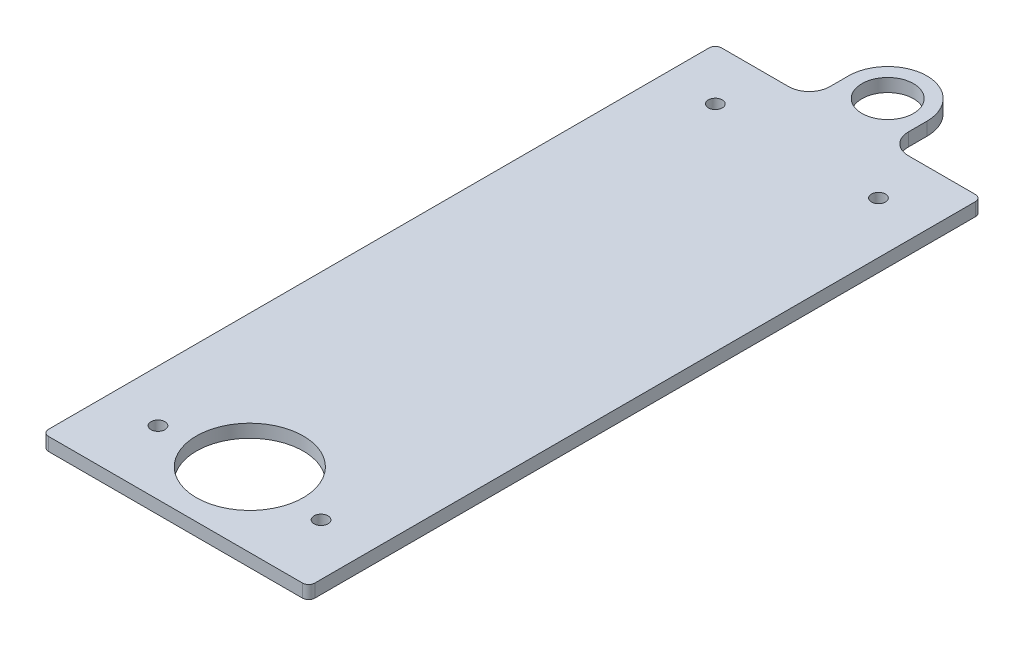
ISO-10303-21;
HEADER;
FILE_DESCRIPTION(('STEP AP214'),'2;1');
FILE_NAME('part.step','',(''),(''),'','','');
FILE_SCHEMA(('AUTOMOTIVE_DESIGN { 1 0 10303 214 1 1 1 1 }'));
ENDSEC;
DATA;
#1=APPLICATION_CONTEXT('core data for automotive mechanical design processes');
#2=APPLICATION_PROTOCOL_DEFINITION('international standard','automotive_design',2000,#1);
#3=PRODUCT_CONTEXT('',#1,'mechanical');
#4=PRODUCT('Part','Part','',(#3));
#5=PRODUCT_RELATED_PRODUCT_CATEGORY('part','',(#4));
#6=PRODUCT_DEFINITION_FORMATION('','',#4);
#7=PRODUCT_DEFINITION_CONTEXT('part definition',#1,'design');
#8=PRODUCT_DEFINITION('design','',#6,#7);
#9=PRODUCT_DEFINITION_SHAPE('','',#8);
#10=(LENGTH_UNIT() NAMED_UNIT(*) SI_UNIT(.MILLI.,.METRE.));
#11=(NAMED_UNIT(*) PLANE_ANGLE_UNIT() SI_UNIT($,.RADIAN.));
#12=(NAMED_UNIT(*) SI_UNIT($,.STERADIAN.) SOLID_ANGLE_UNIT());
#13=UNCERTAINTY_MEASURE_WITH_UNIT(LENGTH_MEASURE(1.E-05),#10,'distance_accuracy_value','');
#14=(GEOMETRIC_REPRESENTATION_CONTEXT(3) GLOBAL_UNCERTAINTY_ASSIGNED_CONTEXT((#13)) GLOBAL_UNIT_ASSIGNED_CONTEXT((#10,
#11,#12)) REPRESENTATION_CONTEXT('',''));
#15=CARTESIAN_POINT('',(0.,0.,0.));
#16=DIRECTION('',(0.,0.,1.));
#17=DIRECTION('',(1.,0.,0.));
#18=AXIS2_PLACEMENT_3D('',#15,#16,#17);
#19=CARTESIAN_POINT('',(0.,6.35,-179.));
#20=DIRECTION('',(0.,1.,0.));
#21=DIRECTION('',(0.,0.,1.));
#22=AXIS2_PLACEMENT_3D('',#19,#20,#21);
#23=PLANE('',#22);
#24=CARTESIAN_POINT('',(-39.5,6.35,-135.));
#25=DIRECTION('',(0.,1.,0.));
#26=DIRECTION('',(0.,0.,1.));
#27=AXIS2_PLACEMENT_3D('',#24,#25,#26);
#28=CIRCLE('',#27,3.3782);
#29=CARTESIAN_POINT('',(-39.5,6.35,-131.6218));
#30=VERTEX_POINT('',#29);
#31=EDGE_CURVE('E373',#30,#30,#28,.T.);
#32=ORIENTED_EDGE('',*,*,#31,.F.);
#33=EDGE_LOOP('',(#32));
#34=FACE_BOUND('',#33,.T.);
#35=CARTESIAN_POINT('',(39.5,6.35,-135.));
#36=DIRECTION('',(0.,1.,0.));
#37=DIRECTION('',(0.,0.,1.));
#38=AXIS2_PLACEMENT_3D('',#35,#36,#37);
#39=CIRCLE('',#38,3.3782);
#40=CARTESIAN_POINT('',(39.5,6.35,-131.6218));
#41=VERTEX_POINT('',#40);
#42=EDGE_CURVE('E367',#41,#41,#39,.T.);
#43=ORIENTED_EDGE('',*,*,#42,.F.);
#44=EDGE_LOOP('',(#43));
#45=FACE_BOUND('',#44,.T.);
#46=CARTESIAN_POINT('',(39.5,6.35,135.));
#47=DIRECTION('',(0.,1.,0.));
#48=DIRECTION('',(0.,0.,1.));
#49=AXIS2_PLACEMENT_3D('',#46,#47,#48);
#50=CIRCLE('',#49,3.3782);
#51=CARTESIAN_POINT('',(39.5,6.35,138.3782));
#52=VERTEX_POINT('',#51);
#53=EDGE_CURVE('E361',#52,#52,#50,.T.);
#54=ORIENTED_EDGE('',*,*,#53,.F.);
#55=EDGE_LOOP('',(#54));
#56=FACE_BOUND('',#55,.T.);
#57=CARTESIAN_POINT('',(-39.5,6.35,135.));
#58=DIRECTION('',(0.,1.,0.));
#59=DIRECTION('',(0.,0.,1.));
#60=AXIS2_PLACEMENT_3D('',#57,#58,#59);
#61=CIRCLE('',#60,3.3782);
#62=CARTESIAN_POINT('',(-39.5,6.35,138.3782));
#63=VERTEX_POINT('',#62);
#64=EDGE_CURVE('E355',#63,#63,#61,.T.);
#65=ORIENTED_EDGE('',*,*,#64,.F.);
#66=EDGE_LOOP('',(#65));
#67=FACE_BOUND('',#66,.T.);
#68=CARTESIAN_POINT('',(0.,6.35,130.));
#69=DIRECTION('',(0.,1.,0.));
#70=DIRECTION('',(0.,0.,1.));
#71=AXIS2_PLACEMENT_3D('',#68,#69,#70);
#72=CIRCLE('',#71,25.9);
#73=CARTESIAN_POINT('',(0.,6.35,155.9));
#74=VERTEX_POINT('',#73);
#75=EDGE_CURVE('E177',#74,#74,#72,.T.);
#76=ORIENTED_EDGE('',*,*,#75,.F.);
#77=EDGE_LOOP('',(#76));
#78=FACE_BOUND('',#77,.T.);
#79=DIRECTION('',(1.,0.,0.));
#80=VECTOR('',#79,1.);
#81=CARTESIAN_POINT('',(-64.5,6.35,166.));
#82=LINE('',#81,#80);
#83=CARTESIAN_POINT('',(-61.5,6.35,166.));
#84=VERTEX_POINT('',#83);
#85=CARTESIAN_POINT('',(61.5,6.35,166.));
#86=VERTEX_POINT('',#85);
#87=EDGE_CURVE('E171',#84,#86,#82,.T.);
#88=ORIENTED_EDGE('',*,*,#87,.T.);
#89=CARTESIAN_POINT('',(61.5,6.35,163.));
#90=DIRECTION('',(0.,1.,0.));
#91=DIRECTION('',(0.,0.,1.));
#92=AXIS2_PLACEMENT_3D('',#89,#90,#91);
#93=CIRCLE('',#92,3.);
#94=CARTESIAN_POINT('',(64.5,6.35,163.));
#95=VERTEX_POINT('',#94);
#96=EDGE_CURVE('E235',#86,#95,#93,.T.);
#97=ORIENTED_EDGE('',*,*,#96,.T.);
#98=DIRECTION('',(0.,0.,-1.));
#99=VECTOR('',#98,1.);
#100=CARTESIAN_POINT('',(64.5,6.35,-160.));
#101=LINE('',#100,#99);
#102=CARTESIAN_POINT('',(64.5,6.35,-157.));
#103=VERTEX_POINT('',#102);
#104=EDGE_CURVE('E193',#95,#103,#101,.T.);
#105=ORIENTED_EDGE('',*,*,#104,.T.);
#106=CARTESIAN_POINT('',(61.5,6.35,-157.));
#107=DIRECTION('',(0.,1.,0.));
#108=DIRECTION('',(0.,0.,1.));
#109=AXIS2_PLACEMENT_3D('',#106,#107,#108);
#110=CIRCLE('',#109,3.);
#111=CARTESIAN_POINT('',(61.5,6.35,-160.));
#112=VERTEX_POINT('',#111);
#113=EDGE_CURVE('E231',#103,#112,#110,.T.);
#114=ORIENTED_EDGE('',*,*,#113,.T.);
#115=DIRECTION('',(-1.,0.,0.));
#116=VECTOR('',#115,1.);
#117=CARTESIAN_POINT('',(19.,6.35,-160.));
#118=LINE('',#117,#116);
#119=CARTESIAN_POINT('',(29.,6.35,-160.));
#120=VERTEX_POINT('',#119);
#121=EDGE_CURVE('E147',#112,#120,#118,.T.);
#122=ORIENTED_EDGE('',*,*,#121,.T.);
#123=CARTESIAN_POINT('',(29.,6.35,-170.));
#124=DIRECTION('',(0.,1.,0.));
#125=DIRECTION('',(0.,0.,1.));
#126=AXIS2_PLACEMENT_3D('',#123,#124,#125);
#127=CIRCLE('',#126,10.);
#128=CARTESIAN_POINT('',(19.,6.35,-170.));
#129=VERTEX_POINT('',#128);
#130=EDGE_CURVE('E143',#120,#129,#127,.F.);
#131=ORIENTED_EDGE('',*,*,#130,.T.);
#132=DIRECTION('',(0.,0.,-1.));
#133=VECTOR('',#132,1.);
#134=CARTESIAN_POINT('',(19.,6.35,-160.));
#135=LINE('',#134,#133);
#136=CARTESIAN_POINT('',(19.,6.35,-179.));
#137=VERTEX_POINT('',#136);
#138=EDGE_CURVE('E134',#129,#137,#135,.T.);
#139=ORIENTED_EDGE('',*,*,#138,.T.);
#140=CARTESIAN_POINT('',(0.,6.35,-179.));
#141=DIRECTION('',(0.,1.,0.));
#142=DIRECTION('',(0.,0.,1.));
#143=AXIS2_PLACEMENT_3D('',#140,#141,#142);
#144=CIRCLE('',#143,19.);
#145=CARTESIAN_POINT('',(-19.0000000000001,6.35,-179.));
#146=VERTEX_POINT('',#145);
#147=EDGE_CURVE('E140',#137,#146,#144,.T.);
#148=ORIENTED_EDGE('',*,*,#147,.T.);
#149=DIRECTION('',(0.,0.,1.));
#150=VECTOR('',#149,1.);
#151=CARTESIAN_POINT('',(-19.0000000000001,6.35,-160.));
#152=LINE('',#151,#150);
#153=CARTESIAN_POINT('',(-19.0000000000001,6.35,-170.));
#154=VERTEX_POINT('',#153);
#155=EDGE_CURVE('E162',#146,#154,#152,.T.);
#156=ORIENTED_EDGE('',*,*,#155,.T.);
#157=CARTESIAN_POINT('',(-29.0000000000001,6.35,-170.));
#158=DIRECTION('',(0.,1.,0.));
#159=DIRECTION('',(0.,0.,1.));
#160=AXIS2_PLACEMENT_3D('',#157,#158,#159);
#161=CIRCLE('',#160,10.);
#162=CARTESIAN_POINT('',(-29.0000000000001,6.35,-160.));
#163=VERTEX_POINT('',#162);
#164=EDGE_CURVE('E206',#154,#163,#161,.F.);
#165=ORIENTED_EDGE('',*,*,#164,.T.);
#166=DIRECTION('',(-1.,0.,0.));
#167=VECTOR('',#166,1.);
#168=CARTESIAN_POINT('',(-64.5,6.35,-160.));
#169=LINE('',#168,#167);
#170=CARTESIAN_POINT('',(-61.5,6.35,-160.));
#171=VERTEX_POINT('',#170);
#172=EDGE_CURVE('E164',#163,#171,#169,.T.);
#173=ORIENTED_EDGE('',*,*,#172,.T.);
#174=CARTESIAN_POINT('',(-61.5,6.35,-157.));
#175=DIRECTION('',(0.,1.,0.));
#176=DIRECTION('',(0.,0.,1.));
#177=AXIS2_PLACEMENT_3D('',#174,#175,#176);
#178=CIRCLE('',#177,3.);
#179=CARTESIAN_POINT('',(-64.5,6.35,-157.));
#180=VERTEX_POINT('',#179);
#181=EDGE_CURVE('E56',#171,#180,#178,.T.);
#182=ORIENTED_EDGE('',*,*,#181,.T.);
#183=DIRECTION('',(0.,0.,1.));
#184=VECTOR('',#183,1.);
#185=CARTESIAN_POINT('',(-64.5,6.35,-160.));
#186=LINE('',#185,#184);
#187=CARTESIAN_POINT('',(-64.5,6.35,163.));
#188=VERTEX_POINT('',#187);
#189=EDGE_CURVE('E169',#180,#188,#186,.T.);
#190=ORIENTED_EDGE('',*,*,#189,.T.);
#191=CARTESIAN_POINT('',(-61.5,6.35,163.));
#192=DIRECTION('',(0.,1.,0.));
#193=DIRECTION('',(0.,0.,1.));
#194=AXIS2_PLACEMENT_3D('',#191,#192,#193);
#195=CIRCLE('',#194,3.);
#196=EDGE_CURVE('E233',#188,#84,#195,.T.);
#197=ORIENTED_EDGE('',*,*,#196,.T.);
#198=EDGE_LOOP('',(#88,#97,#105,#114,#122,#131,#139,#148,#156,#165,#173,#182,#190,#197));
#199=FACE_BOUND('',#198,.T.);
#200=CARTESIAN_POINT('',(0.,6.35,-179.));
#201=DIRECTION('',(0.,1.,0.));
#202=DIRECTION('',(0.,0.,1.));
#203=AXIS2_PLACEMENT_3D('',#200,#201,#202);
#204=CIRCLE('',#203,12.5);
#205=CARTESIAN_POINT('',(0.,6.35,-166.5));
#206=VERTEX_POINT('',#205);
#207=EDGE_CURVE('E344',#206,#206,#204,.T.);
#208=ORIENTED_EDGE('',*,*,#207,.F.);
#209=EDGE_LOOP('',(#208));
#210=FACE_BOUND('',#209,.T.);
#211=ADVANCED_FACE('F34',(#34,#45,#56,#67,#78,#199,#210),#23,.T.);
#212=CARTESIAN_POINT('',(0.,0.,-179.));
#213=DIRECTION('',(0.,1.,0.));
#214=DIRECTION('',(0.,0.,1.));
#215=AXIS2_PLACEMENT_3D('',#212,#213,#214);
#216=PLANE('',#215);
#217=CARTESIAN_POINT('',(-39.5,0.,-135.));
#218=DIRECTION('',(0.,1.,0.));
#219=DIRECTION('',(0.,0.,1.));
#220=AXIS2_PLACEMENT_3D('',#217,#218,#219);
#221=CIRCLE('',#220,3.3782);
#222=CARTESIAN_POINT('',(-39.5,0.,-131.6218));
#223=VERTEX_POINT('',#222);
#224=EDGE_CURVE('E370',#223,#223,#221,.T.);
#225=ORIENTED_EDGE('',*,*,#224,.T.);
#226=EDGE_LOOP('',(#225));
#227=FACE_BOUND('',#226,.T.);
#228=CARTESIAN_POINT('',(39.5,0.,-135.));
#229=DIRECTION('',(0.,1.,0.));
#230=DIRECTION('',(0.,0.,1.));
#231=AXIS2_PLACEMENT_3D('',#228,#229,#230);
#232=CIRCLE('',#231,3.3782);
#233=CARTESIAN_POINT('',(39.5,0.,-131.6218));
#234=VERTEX_POINT('',#233);
#235=EDGE_CURVE('E364',#234,#234,#232,.T.);
#236=ORIENTED_EDGE('',*,*,#235,.T.);
#237=EDGE_LOOP('',(#236));
#238=FACE_BOUND('',#237,.T.);
#239=CARTESIAN_POINT('',(39.5,0.,135.));
#240=DIRECTION('',(0.,1.,0.));
#241=DIRECTION('',(0.,0.,1.));
#242=AXIS2_PLACEMENT_3D('',#239,#240,#241);
#243=CIRCLE('',#242,3.3782);
#244=CARTESIAN_POINT('',(39.5,0.,138.3782));
#245=VERTEX_POINT('',#244);
#246=EDGE_CURVE('E358',#245,#245,#243,.T.);
#247=ORIENTED_EDGE('',*,*,#246,.T.);
#248=EDGE_LOOP('',(#247));
#249=FACE_BOUND('',#248,.T.);
#250=CARTESIAN_POINT('',(-39.5,0.,135.));
#251=DIRECTION('',(0.,1.,0.));
#252=DIRECTION('',(0.,0.,1.));
#253=AXIS2_PLACEMENT_3D('',#250,#251,#252);
#254=CIRCLE('',#253,3.3782);
#255=CARTESIAN_POINT('',(-39.5,0.,138.3782));
#256=VERTEX_POINT('',#255);
#257=EDGE_CURVE('E350',#256,#256,#254,.T.);
#258=ORIENTED_EDGE('',*,*,#257,.T.);
#259=EDGE_LOOP('',(#258));
#260=FACE_BOUND('',#259,.T.);
#261=CARTESIAN_POINT('',(0.,0.,130.));
#262=DIRECTION('',(0.,1.,0.));
#263=DIRECTION('',(0.,0.,1.));
#264=AXIS2_PLACEMENT_3D('',#261,#262,#263);
#265=CIRCLE('',#264,25.9);
#266=CARTESIAN_POINT('',(0.,0.,155.9));
#267=VERTEX_POINT('',#266);
#268=EDGE_CURVE('E341',#267,#267,#265,.T.);
#269=ORIENTED_EDGE('',*,*,#268,.T.);
#270=EDGE_LOOP('',(#269));
#271=FACE_BOUND('',#270,.T.);
#272=DIRECTION('',(0.,0.,-1.));
#273=VECTOR('',#272,1.);
#274=CARTESIAN_POINT('',(64.5,0.,-160.));
#275=LINE('',#274,#273);
#276=CARTESIAN_POINT('',(64.5,0.,163.));
#277=VERTEX_POINT('',#276);
#278=CARTESIAN_POINT('',(64.5,0.,-157.));
#279=VERTEX_POINT('',#278);
#280=EDGE_CURVE('E173',#277,#279,#275,.T.);
#281=ORIENTED_EDGE('',*,*,#280,.F.);
#282=CARTESIAN_POINT('',(61.5,0.,163.));
#283=DIRECTION('',(0.,1.,0.));
#284=DIRECTION('',(0.,0.,1.));
#285=AXIS2_PLACEMENT_3D('',#282,#283,#284);
#286=CIRCLE('',#285,3.);
#287=CARTESIAN_POINT('',(61.5,0.,166.));
#288=VERTEX_POINT('',#287);
#289=EDGE_CURVE('E223',#277,#288,#286,.F.);
#290=ORIENTED_EDGE('',*,*,#289,.T.);
#291=DIRECTION('',(1.,0.,0.));
#292=VECTOR('',#291,1.);
#293=CARTESIAN_POINT('',(-64.5,0.,166.));
#294=LINE('',#293,#292);
#295=CARTESIAN_POINT('',(-61.5,0.,166.));
#296=VERTEX_POINT('',#295);
#297=EDGE_CURVE('E190',#296,#288,#294,.T.);
#298=ORIENTED_EDGE('',*,*,#297,.F.);
#299=CARTESIAN_POINT('',(-61.5,0.,163.));
#300=DIRECTION('',(0.,1.,0.));
#301=DIRECTION('',(0.,0.,1.));
#302=AXIS2_PLACEMENT_3D('',#299,#300,#301);
#303=CIRCLE('',#302,3.);
#304=CARTESIAN_POINT('',(-64.5,0.,163.));
#305=VERTEX_POINT('',#304);
#306=EDGE_CURVE('E221',#296,#305,#303,.F.);
#307=ORIENTED_EDGE('',*,*,#306,.T.);
#308=DIRECTION('',(0.,0.,1.));
#309=VECTOR('',#308,1.);
#310=CARTESIAN_POINT('',(-64.5,0.,-160.));
#311=LINE('',#310,#309);
#312=CARTESIAN_POINT('',(-64.5,0.,-157.));
#313=VERTEX_POINT('',#312);
#314=EDGE_CURVE('E188',#313,#305,#311,.T.);
#315=ORIENTED_EDGE('',*,*,#314,.F.);
#316=CARTESIAN_POINT('',(-61.5,0.,-157.));
#317=DIRECTION('',(0.,1.,0.));
#318=DIRECTION('',(0.,0.,1.));
#319=AXIS2_PLACEMENT_3D('',#316,#317,#318);
#320=CIRCLE('',#319,3.);
#321=CARTESIAN_POINT('',(-61.5,0.,-160.));
#322=VERTEX_POINT('',#321);
#323=EDGE_CURVE('E217',#313,#322,#320,.F.);
#324=ORIENTED_EDGE('',*,*,#323,.T.);
#325=DIRECTION('',(-1.,0.,0.));
#326=VECTOR('',#325,1.);
#327=CARTESIAN_POINT('',(-64.5,0.,-160.));
#328=LINE('',#327,#326);
#329=CARTESIAN_POINT('',(-29.0000000000001,0.,-160.));
#330=VERTEX_POINT('',#329);
#331=EDGE_CURVE('E185',#330,#322,#328,.T.);
#332=ORIENTED_EDGE('',*,*,#331,.F.);
#333=CARTESIAN_POINT('',(-29.0000000000001,0.,-170.));
#334=DIRECTION('',(0.,1.,0.));
#335=DIRECTION('',(0.,0.,1.));
#336=AXIS2_PLACEMENT_3D('',#333,#334,#335);
#337=CIRCLE('',#336,10.);
#338=CARTESIAN_POINT('',(-19.0000000000001,0.,-170.));
#339=VERTEX_POINT('',#338);
#340=EDGE_CURVE('E204',#330,#339,#337,.T.);
#341=ORIENTED_EDGE('',*,*,#340,.T.);
#342=DIRECTION('',(0.,0.,1.));
#343=VECTOR('',#342,1.);
#344=CARTESIAN_POINT('',(-19.0000000000001,0.,-160.));
#345=LINE('',#344,#343);
#346=CARTESIAN_POINT('',(-19.0000000000001,0.,-179.));
#347=VERTEX_POINT('',#346);
#348=EDGE_CURVE('E182',#347,#339,#345,.T.);
#349=ORIENTED_EDGE('',*,*,#348,.F.);
#350=CARTESIAN_POINT('',(0.,0.,-179.));
#351=DIRECTION('',(0.,1.,0.));
#352=DIRECTION('',(0.,0.,1.));
#353=AXIS2_PLACEMENT_3D('',#350,#351,#352);
#354=CIRCLE('',#353,19.);
#355=CARTESIAN_POINT('',(19.,0.,-179.));
#356=VERTEX_POINT('',#355);
#357=EDGE_CURVE('E180',#356,#347,#354,.T.);
#358=ORIENTED_EDGE('',*,*,#357,.F.);
#359=DIRECTION('',(0.,0.,-1.));
#360=VECTOR('',#359,1.);
#361=CARTESIAN_POINT('',(19.,0.,-160.));
#362=LINE('',#361,#360);
#363=CARTESIAN_POINT('',(19.,0.,-170.));
#364=VERTEX_POINT('',#363);
#365=EDGE_CURVE('E153',#364,#356,#362,.T.);
#366=ORIENTED_EDGE('',*,*,#365,.F.);
#367=CARTESIAN_POINT('',(29.,0.,-170.));
#368=DIRECTION('',(0.,1.,0.));
#369=DIRECTION('',(0.,0.,1.));
#370=AXIS2_PLACEMENT_3D('',#367,#368,#369);
#371=CIRCLE('',#370,10.);
#372=CARTESIAN_POINT('',(29.,0.,-160.));
#373=VERTEX_POINT('',#372);
#374=EDGE_CURVE('E208',#364,#373,#371,.T.);
#375=ORIENTED_EDGE('',*,*,#374,.T.);
#376=DIRECTION('',(-1.,0.,0.));
#377=VECTOR('',#376,1.);
#378=CARTESIAN_POINT('',(19.,0.,-160.));
#379=LINE('',#378,#377);
#380=CARTESIAN_POINT('',(61.5,0.,-160.));
#381=VERTEX_POINT('',#380);
#382=EDGE_CURVE('E176',#381,#373,#379,.T.);
#383=ORIENTED_EDGE('',*,*,#382,.F.);
#384=CARTESIAN_POINT('',(61.5,0.,-157.));
#385=DIRECTION('',(0.,1.,0.));
#386=DIRECTION('',(0.,0.,1.));
#387=AXIS2_PLACEMENT_3D('',#384,#385,#386);
#388=CIRCLE('',#387,3.);
#389=EDGE_CURVE('E219',#381,#279,#388,.F.);
#390=ORIENTED_EDGE('',*,*,#389,.T.);
#391=EDGE_LOOP('',(#281,#290,#298,#307,#315,#324,#332,#341,#349,#358,#366,#375,#383,#390));
#392=FACE_BOUND('',#391,.T.);
#393=CARTESIAN_POINT('',(0.,0.,-179.));
#394=DIRECTION('',(0.,1.,0.));
#395=DIRECTION('',(0.,0.,1.));
#396=AXIS2_PLACEMENT_3D('',#393,#394,#395);
#397=CIRCLE('',#396,12.5);
#398=CARTESIAN_POINT('',(0.,0.,-166.5));
#399=VERTEX_POINT('',#398);
#400=EDGE_CURVE('E347',#399,#399,#397,.T.);
#401=ORIENTED_EDGE('',*,*,#400,.T.);
#402=EDGE_LOOP('',(#401));
#403=FACE_BOUND('',#402,.T.);
#404=ADVANCED_FACE('F250',(#227,#238,#249,#260,#271,#392,#403),#216,.F.);
#405=CARTESIAN_POINT('',(64.5,6.35,-160.));
#406=DIRECTION('',(-1.,0.,0.));
#407=DIRECTION('',(0.,0.,1.));
#408=AXIS2_PLACEMENT_3D('',#405,#406,#407);
#409=PLANE('',#408);
#410=ORIENTED_EDGE('',*,*,#104,.F.);
#411=DIRECTION('',(0.,-1.,0.));
#412=VECTOR('',#411,1.);
#413=CARTESIAN_POINT('',(64.5,6.35,163.));
#414=LINE('',#413,#412);
#415=EDGE_CURVE('E214',#95,#277,#414,.T.);
#416=ORIENTED_EDGE('',*,*,#415,.T.);
#417=ORIENTED_EDGE('',*,*,#280,.T.);
#418=DIRECTION('',(0.,-1.,0.));
#419=VECTOR('',#418,1.);
#420=CARTESIAN_POINT('',(64.5,6.35,-157.));
#421=LINE('',#420,#419);
#422=EDGE_CURVE('E212',#279,#103,#421,.F.);
#423=ORIENTED_EDGE('',*,*,#422,.T.);
#424=EDGE_LOOP('',(#410,#416,#417,#423));
#425=FACE_BOUND('',#424,.T.);
#426=ADVANCED_FACE('F275',(#425),#409,.F.);
#427=CARTESIAN_POINT('',(19.,6.35,-160.));
#428=DIRECTION('',(0.,0.,1.));
#429=DIRECTION('',(1.,0.,0.));
#430=AXIS2_PLACEMENT_3D('',#427,#428,#429);
#431=PLANE('',#430);
#432=ORIENTED_EDGE('',*,*,#121,.F.);
#433=DIRECTION('',(0.,-1.,0.));
#434=VECTOR('',#433,1.);
#435=CARTESIAN_POINT('',(61.5,6.35,-160.));
#436=LINE('',#435,#434);
#437=EDGE_CURVE('E42',#112,#381,#436,.T.);
#438=ORIENTED_EDGE('',*,*,#437,.T.);
#439=ORIENTED_EDGE('',*,*,#382,.T.);
#440=DIRECTION('',(0.,-1.,0.));
#441=VECTOR('',#440,1.);
#442=CARTESIAN_POINT('',(29.,6.35,-160.));
#443=LINE('',#442,#441);
#444=EDGE_CURVE('E201',#373,#120,#443,.F.);
#445=ORIENTED_EDGE('',*,*,#444,.T.);
#446=EDGE_LOOP('',(#432,#438,#439,#445));
#447=FACE_BOUND('',#446,.T.);
#448=ADVANCED_FACE('F245',(#447),#431,.F.);
#449=CARTESIAN_POINT('',(19.,6.35,-160.));
#450=DIRECTION('',(-1.,0.,0.));
#451=DIRECTION('',(0.,0.,1.));
#452=AXIS2_PLACEMENT_3D('',#449,#450,#451);
#453=PLANE('',#452);
#454=ORIENTED_EDGE('',*,*,#138,.F.);
#455=DIRECTION('',(0.,-1.,0.));
#456=VECTOR('',#455,1.);
#457=CARTESIAN_POINT('',(19.,0.,-170.));
#458=LINE('',#457,#456);
#459=EDGE_CURVE('E199',#129,#364,#458,.T.);
#460=ORIENTED_EDGE('',*,*,#459,.T.);
#461=ORIENTED_EDGE('',*,*,#365,.T.);
#462=DIRECTION('',(0.,-1.,0.));
#463=VECTOR('',#462,1.);
#464=CARTESIAN_POINT('',(19.,6.35,-179.));
#465=LINE('',#464,#463);
#466=EDGE_CURVE('E150',#137,#356,#465,.T.);
#467=ORIENTED_EDGE('',*,*,#466,.F.);
#468=EDGE_LOOP('',(#454,#460,#461,#467));
#469=FACE_BOUND('',#468,.T.);
#470=ADVANCED_FACE('F151',(#469),#453,.F.);
#471=CARTESIAN_POINT('',(0.,6.35,-179.));
#472=DIRECTION('',(0.,-1.,0.));
#473=DIRECTION('',(0.,0.,-1.));
#474=AXIS2_PLACEMENT_3D('',#471,#472,#473);
#475=CYLINDRICAL_SURFACE('',#474,19.);
#476=ORIENTED_EDGE('',*,*,#357,.T.);
#477=DIRECTION('',(0.,-1.,0.));
#478=VECTOR('',#477,1.);
#479=CARTESIAN_POINT('',(-19.0000000000001,6.35,-179.));
#480=LINE('',#479,#478);
#481=EDGE_CURVE('E157',#146,#347,#480,.T.);
#482=ORIENTED_EDGE('',*,*,#481,.F.);
#483=ORIENTED_EDGE('',*,*,#147,.F.);
#484=ORIENTED_EDGE('',*,*,#466,.T.);
#485=EDGE_LOOP('',(#476,#482,#483,#484));
#486=FACE_BOUND('',#485,.T.);
#487=ADVANCED_FACE('F159',(#486),#475,.T.);
#488=CARTESIAN_POINT('',(-19.0000000000001,6.35,-160.));
#489=DIRECTION('',(1.,0.,0.));
#490=DIRECTION('',(0.,0.,-1.));
#491=AXIS2_PLACEMENT_3D('',#488,#489,#490);
#492=PLANE('',#491);
#493=ORIENTED_EDGE('',*,*,#348,.T.);
#494=DIRECTION('',(0.,-1.,0.));
#495=VECTOR('',#494,1.);
#496=CARTESIAN_POINT('',(-19.0000000000001,6.35,-170.));
#497=LINE('',#496,#495);
#498=EDGE_CURVE('E197',#339,#154,#497,.F.);
#499=ORIENTED_EDGE('',*,*,#498,.T.);
#500=ORIENTED_EDGE('',*,*,#155,.F.);
#501=ORIENTED_EDGE('',*,*,#481,.T.);
#502=EDGE_LOOP('',(#493,#499,#500,#501));
#503=FACE_BOUND('',#502,.T.);
#504=ADVANCED_FACE('F294',(#503),#492,.F.);
#505=CARTESIAN_POINT('',(-64.5,6.35,-160.));
#506=DIRECTION('',(0.,0.,1.));
#507=DIRECTION('',(1.,0.,0.));
#508=AXIS2_PLACEMENT_3D('',#505,#506,#507);
#509=PLANE('',#508);
#510=ORIENTED_EDGE('',*,*,#331,.T.);
#511=DIRECTION('',(0.,-1.,0.));
#512=VECTOR('',#511,1.);
#513=CARTESIAN_POINT('',(-61.5,6.35,-160.));
#514=LINE('',#513,#512);
#515=EDGE_CURVE('E11',#322,#171,#514,.F.);
#516=ORIENTED_EDGE('',*,*,#515,.T.);
#517=ORIENTED_EDGE('',*,*,#172,.F.);
#518=DIRECTION('',(0.,-1.,0.));
#519=VECTOR('',#518,1.);
#520=CARTESIAN_POINT('',(-29.0000000000001,0.,-160.));
#521=LINE('',#520,#519);
#522=EDGE_CURVE('E156',#163,#330,#521,.T.);
#523=ORIENTED_EDGE('',*,*,#522,.T.);
#524=EDGE_LOOP('',(#510,#516,#517,#523));
#525=FACE_BOUND('',#524,.T.);
#526=ADVANCED_FACE('F291',(#525),#509,.F.);
#527=CARTESIAN_POINT('',(-64.5,6.35,-160.));
#528=DIRECTION('',(1.,0.,0.));
#529=DIRECTION('',(0.,0.,-1.));
#530=AXIS2_PLACEMENT_3D('',#527,#528,#529);
#531=PLANE('',#530);
#532=ORIENTED_EDGE('',*,*,#314,.T.);
#533=DIRECTION('',(0.,-1.,0.));
#534=VECTOR('',#533,1.);
#535=CARTESIAN_POINT('',(-64.5,6.35,163.));
#536=LINE('',#535,#534);
#537=EDGE_CURVE('E49',#305,#188,#536,.F.);
#538=ORIENTED_EDGE('',*,*,#537,.T.);
#539=ORIENTED_EDGE('',*,*,#189,.F.);
#540=DIRECTION('',(0.,-1.,0.));
#541=VECTOR('',#540,1.);
#542=CARTESIAN_POINT('',(-64.5,6.35,-157.));
#543=LINE('',#542,#541);
#544=EDGE_CURVE('E237',#180,#313,#543,.T.);
#545=ORIENTED_EDGE('',*,*,#544,.T.);
#546=EDGE_LOOP('',(#532,#538,#539,#545));
#547=FACE_BOUND('',#546,.T.);
#548=ADVANCED_FACE('F287',(#547),#531,.F.);
#549=CARTESIAN_POINT('',(-64.5,6.35,166.));
#550=DIRECTION('',(0.,0.,-1.));
#551=DIRECTION('',(-1.,0.,0.));
#552=AXIS2_PLACEMENT_3D('',#549,#550,#551);
#553=PLANE('',#552);
#554=ORIENTED_EDGE('',*,*,#297,.T.);
#555=DIRECTION('',(0.,-1.,0.));
#556=VECTOR('',#555,1.);
#557=CARTESIAN_POINT('',(61.5,6.35,166.));
#558=LINE('',#557,#556);
#559=EDGE_CURVE('E228',#288,#86,#558,.F.);
#560=ORIENTED_EDGE('',*,*,#559,.T.);
#561=ORIENTED_EDGE('',*,*,#87,.F.);
#562=DIRECTION('',(0.,-1.,0.));
#563=VECTOR('',#562,1.);
#564=CARTESIAN_POINT('',(-61.5,6.35,166.));
#565=LINE('',#564,#563);
#566=EDGE_CURVE('E225',#84,#296,#565,.T.);
#567=ORIENTED_EDGE('',*,*,#566,.T.);
#568=EDGE_LOOP('',(#554,#560,#561,#567));
#569=FACE_BOUND('',#568,.T.);
#570=ADVANCED_FACE('F284',(#569),#553,.F.);
#571=CARTESIAN_POINT('',(0.,6.35,130.));
#572=DIRECTION('',(0.,-1.,0.));
#573=DIRECTION('',(0.,0.,-1.));
#574=AXIS2_PLACEMENT_3D('',#571,#572,#573);
#575=CYLINDRICAL_SURFACE('',#574,25.9);
#576=ORIENTED_EDGE('',*,*,#75,.T.);
#577=EDGE_LOOP('',(#576));
#578=FACE_BOUND('',#577,.T.);
#579=ORIENTED_EDGE('',*,*,#268,.F.);
#580=EDGE_LOOP('',(#579));
#581=FACE_BOUND('',#580,.T.);
#582=ADVANCED_FACE('F281',(#578,#581),#575,.F.);
#583=CARTESIAN_POINT('',(0.,6.35,-179.));
#584=DIRECTION('',(0.,-1.,0.));
#585=DIRECTION('',(0.,0.,-1.));
#586=AXIS2_PLACEMENT_3D('',#583,#584,#585);
#587=CYLINDRICAL_SURFACE('',#586,12.5);
#588=ORIENTED_EDGE('',*,*,#207,.T.);
#589=EDGE_LOOP('',(#588));
#590=FACE_BOUND('',#589,.T.);
#591=ORIENTED_EDGE('',*,*,#400,.F.);
#592=EDGE_LOOP('',(#591));
#593=FACE_BOUND('',#592,.T.);
#594=ADVANCED_FACE('F391',(#590,#593),#587,.F.);
#595=CARTESIAN_POINT('',(-39.5,6.35,135.));
#596=DIRECTION('',(0.,1.,0.));
#597=DIRECTION('',(0.,0.,1.));
#598=AXIS2_PLACEMENT_3D('',#595,#596,#597);
#599=CYLINDRICAL_SURFACE('',#598,3.3782);
#600=ORIENTED_EDGE('',*,*,#64,.T.);
#601=EDGE_LOOP('',(#600));
#602=FACE_BOUND('',#601,.T.);
#603=ORIENTED_EDGE('',*,*,#257,.F.);
#604=EDGE_LOOP('',(#603));
#605=FACE_BOUND('',#604,.T.);
#606=ADVANCED_FACE('F396',(#602,#605),#599,.F.);
#607=CARTESIAN_POINT('',(39.5,6.35,135.));
#608=DIRECTION('',(0.,1.,0.));
#609=DIRECTION('',(0.,0.,1.));
#610=AXIS2_PLACEMENT_3D('',#607,#608,#609);
#611=CYLINDRICAL_SURFACE('',#610,3.3782);
#612=ORIENTED_EDGE('',*,*,#53,.T.);
#613=EDGE_LOOP('',(#612));
#614=FACE_BOUND('',#613,.T.);
#615=ORIENTED_EDGE('',*,*,#246,.F.);
#616=EDGE_LOOP('',(#615));
#617=FACE_BOUND('',#616,.T.);
#618=ADVANCED_FACE('F403',(#614,#617),#611,.F.);
#619=CARTESIAN_POINT('',(39.5,6.35,-135.));
#620=DIRECTION('',(0.,1.,0.));
#621=DIRECTION('',(0.,0.,1.));
#622=AXIS2_PLACEMENT_3D('',#619,#620,#621);
#623=CYLINDRICAL_SURFACE('',#622,3.3782);
#624=ORIENTED_EDGE('',*,*,#42,.T.);
#625=EDGE_LOOP('',(#624));
#626=FACE_BOUND('',#625,.T.);
#627=ORIENTED_EDGE('',*,*,#235,.F.);
#628=EDGE_LOOP('',(#627));
#629=FACE_BOUND('',#628,.T.);
#630=ADVANCED_FACE('F378',(#626,#629),#623,.F.);
#631=CARTESIAN_POINT('',(-39.5,6.35,-135.));
#632=DIRECTION('',(0.,1.,0.));
#633=DIRECTION('',(0.,0.,1.));
#634=AXIS2_PLACEMENT_3D('',#631,#632,#633);
#635=CYLINDRICAL_SURFACE('',#634,3.3782);
#636=ORIENTED_EDGE('',*,*,#31,.T.);
#637=EDGE_LOOP('',(#636));
#638=FACE_BOUND('',#637,.T.);
#639=ORIENTED_EDGE('',*,*,#224,.F.);
#640=EDGE_LOOP('',(#639));
#641=FACE_BOUND('',#640,.T.);
#642=ADVANCED_FACE('F266',(#638,#641),#635,.F.);
#643=CARTESIAN_POINT('',(-29.0000000000001,6.35,-170.));
#644=DIRECTION('',(0.,1.,0.));
#645=DIRECTION('',(0.,0.,1.));
#646=AXIS2_PLACEMENT_3D('',#643,#644,#645);
#647=CYLINDRICAL_SURFACE('',#646,10.);
#648=ORIENTED_EDGE('',*,*,#164,.F.);
#649=ORIENTED_EDGE('',*,*,#498,.F.);
#650=ORIENTED_EDGE('',*,*,#340,.F.);
#651=ORIENTED_EDGE('',*,*,#522,.F.);
#652=EDGE_LOOP('',(#648,#649,#650,#651));
#653=FACE_BOUND('',#652,.T.);
#654=ADVANCED_FACE('F257',(#653),#647,.F.);
#655=CARTESIAN_POINT('',(29.,6.35,-170.));
#656=DIRECTION('',(0.,1.,0.));
#657=DIRECTION('',(0.,0.,1.));
#658=AXIS2_PLACEMENT_3D('',#655,#656,#657);
#659=CYLINDRICAL_SURFACE('',#658,10.);
#660=ORIENTED_EDGE('',*,*,#130,.F.);
#661=ORIENTED_EDGE('',*,*,#444,.F.);
#662=ORIENTED_EDGE('',*,*,#374,.F.);
#663=ORIENTED_EDGE('',*,*,#459,.F.);
#664=EDGE_LOOP('',(#660,#661,#662,#663));
#665=FACE_BOUND('',#664,.T.);
#666=ADVANCED_FACE('F254',(#665),#659,.F.);
#667=CARTESIAN_POINT('',(61.5,6.35,163.));
#668=DIRECTION('',(0.,-1.,0.));
#669=DIRECTION('',(0.,0.,-1.));
#670=AXIS2_PLACEMENT_3D('',#667,#668,#669);
#671=CYLINDRICAL_SURFACE('',#670,3.);
#672=ORIENTED_EDGE('',*,*,#96,.F.);
#673=ORIENTED_EDGE('',*,*,#559,.F.);
#674=ORIENTED_EDGE('',*,*,#289,.F.);
#675=ORIENTED_EDGE('',*,*,#415,.F.);
#676=EDGE_LOOP('',(#672,#673,#674,#675));
#677=FACE_BOUND('',#676,.T.);
#678=ADVANCED_FACE('F256',(#677),#671,.T.);
#679=CARTESIAN_POINT('',(-61.5,6.35,163.));
#680=DIRECTION('',(0.,-1.,0.));
#681=DIRECTION('',(0.,0.,-1.));
#682=AXIS2_PLACEMENT_3D('',#679,#680,#681);
#683=CYLINDRICAL_SURFACE('',#682,3.);
#684=ORIENTED_EDGE('',*,*,#196,.F.);
#685=ORIENTED_EDGE('',*,*,#537,.F.);
#686=ORIENTED_EDGE('',*,*,#306,.F.);
#687=ORIENTED_EDGE('',*,*,#566,.F.);
#688=EDGE_LOOP('',(#684,#685,#686,#687));
#689=FACE_BOUND('',#688,.T.);
#690=ADVANCED_FACE('F263',(#689),#683,.T.);
#691=CARTESIAN_POINT('',(61.5,6.35,-157.));
#692=DIRECTION('',(0.,-1.,0.));
#693=DIRECTION('',(0.,0.,-1.));
#694=AXIS2_PLACEMENT_3D('',#691,#692,#693);
#695=CYLINDRICAL_SURFACE('',#694,3.);
#696=ORIENTED_EDGE('',*,*,#113,.F.);
#697=ORIENTED_EDGE('',*,*,#422,.F.);
#698=ORIENTED_EDGE('',*,*,#389,.F.);
#699=ORIENTED_EDGE('',*,*,#437,.F.);
#700=EDGE_LOOP('',(#696,#697,#698,#699));
#701=FACE_BOUND('',#700,.T.);
#702=ADVANCED_FACE('F332',(#701),#695,.T.);
#703=CARTESIAN_POINT('',(-61.5,6.35,-157.));
#704=DIRECTION('',(0.,-1.,0.));
#705=DIRECTION('',(0.,0.,-1.));
#706=AXIS2_PLACEMENT_3D('',#703,#704,#705);
#707=CYLINDRICAL_SURFACE('',#706,3.);
#708=ORIENTED_EDGE('',*,*,#181,.F.);
#709=ORIENTED_EDGE('',*,*,#515,.F.);
#710=ORIENTED_EDGE('',*,*,#323,.F.);
#711=ORIENTED_EDGE('',*,*,#544,.F.);
#712=EDGE_LOOP('',(#708,#709,#710,#711));
#713=FACE_BOUND('',#712,.T.);
#714=ADVANCED_FACE('F36',(#713),#707,.T.);
#715=CLOSED_SHELL('',(#211,#404,#426,#448,#470,#487,#504,#526,#548,#570,#582,#594,#606,#618,
#630,#642,#654,#666,#678,#690,#702,#714));
#716=MANIFOLD_SOLID_BREP('B2',#715);
#717=ADVANCED_BREP_SHAPE_REPRESENTATION('',(#18,#716),#14);
#718=SHAPE_DEFINITION_REPRESENTATION(#9,#717);
ENDSEC;
END-ISO-10303-21;
